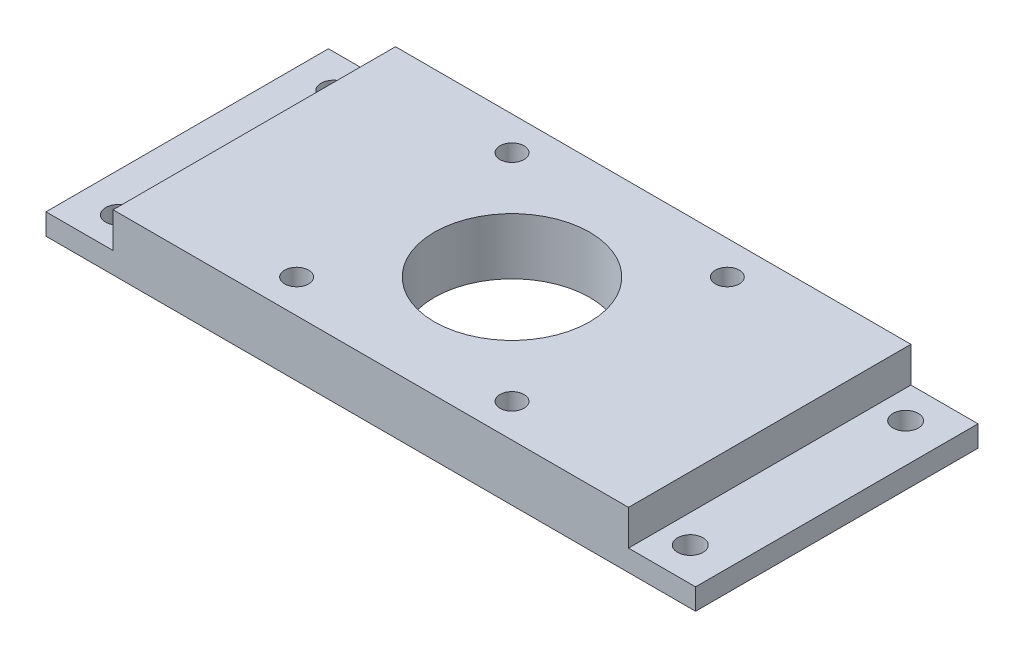
ISO-10303-21;
HEADER;
FILE_DESCRIPTION(('STEP AP214'),'2;1');
FILE_NAME('part.step','',(''),(''),'','','');
FILE_SCHEMA(('AUTOMOTIVE_DESIGN { 1 0 10303 214 1 1 1 1 }'));
ENDSEC;
DATA;
#1=APPLICATION_CONTEXT('core data for automotive mechanical design processes');
#2=APPLICATION_PROTOCOL_DEFINITION('international standard','automotive_design',2000,#1);
#3=PRODUCT_CONTEXT('',#1,'mechanical');
#4=PRODUCT('Part','Part','',(#3));
#5=PRODUCT_RELATED_PRODUCT_CATEGORY('part','',(#4));
#6=PRODUCT_DEFINITION_FORMATION('','',#4);
#7=PRODUCT_DEFINITION_CONTEXT('part definition',#1,'design');
#8=PRODUCT_DEFINITION('design','',#6,#7);
#9=PRODUCT_DEFINITION_SHAPE('','',#8);
#10=(LENGTH_UNIT() NAMED_UNIT(*) SI_UNIT(.MILLI.,.METRE.));
#11=(NAMED_UNIT(*) PLANE_ANGLE_UNIT() SI_UNIT($,.RADIAN.));
#12=(NAMED_UNIT(*) SI_UNIT($,.STERADIAN.) SOLID_ANGLE_UNIT());
#13=UNCERTAINTY_MEASURE_WITH_UNIT(LENGTH_MEASURE(1.E-05),#10,'distance_accuracy_value','');
#14=(GEOMETRIC_REPRESENTATION_CONTEXT(3) GLOBAL_UNCERTAINTY_ASSIGNED_CONTEXT((#13)) GLOBAL_UNIT_ASSIGNED_CONTEXT((#10,
#11,#12)) REPRESENTATION_CONTEXT('',''));
#15=CARTESIAN_POINT('',(0.,0.,0.));
#16=DIRECTION('',(0.,0.,1.));
#17=DIRECTION('',(1.,0.,0.));
#18=AXIS2_PLACEMENT_3D('',#15,#16,#17);
#19=CARTESIAN_POINT('',(36.5,5.,20.));
#20=DIRECTION('',(-1.,0.,0.));
#21=DIRECTION('',(0.,0.,1.));
#22=AXIS2_PLACEMENT_3D('',#19,#20,#21);
#23=PLANE('',#22);
#24=DIRECTION('',(0.,0.,-1.));
#25=VECTOR('',#24,1.);
#26=CARTESIAN_POINT('',(36.5,0.,20.));
#27=LINE('',#26,#25);
#28=CARTESIAN_POINT('',(36.5,0.,20.));
#29=VERTEX_POINT('',#28);
#30=CARTESIAN_POINT('',(36.5,0.,-20.));
#31=VERTEX_POINT('',#30);
#32=EDGE_CURVE('E130',#29,#31,#27,.T.);
#33=ORIENTED_EDGE('',*,*,#32,.T.);
#34=DIRECTION('',(0.,-1.,0.));
#35=VECTOR('',#34,1.);
#36=CARTESIAN_POINT('',(36.5,5.,-20.));
#37=LINE('',#36,#35);
#38=CARTESIAN_POINT('',(36.5,5.,-20.));
#39=VERTEX_POINT('',#38);
#40=EDGE_CURVE('E11',#39,#31,#37,.T.);
#41=ORIENTED_EDGE('',*,*,#40,.F.);
#42=DIRECTION('',(0.,0.,-1.));
#43=VECTOR('',#42,1.);
#44=CARTESIAN_POINT('',(36.5,5.,20.));
#45=LINE('',#44,#43);
#46=CARTESIAN_POINT('',(36.5,5.,20.));
#47=VERTEX_POINT('',#46);
#48=EDGE_CURVE('E141',#47,#39,#45,.T.);
#49=ORIENTED_EDGE('',*,*,#48,.F.);
#50=DIRECTION('',(0.,-1.,0.));
#51=VECTOR('',#50,1.);
#52=CARTESIAN_POINT('',(36.5,5.,20.));
#53=LINE('',#52,#51);
#54=EDGE_CURVE('E151',#47,#29,#53,.T.);
#55=ORIENTED_EDGE('',*,*,#54,.T.);
#56=EDGE_LOOP('',(#33,#41,#49,#55));
#57=FACE_BOUND('',#56,.T.);
#58=ADVANCED_FACE('F39',(#57),#23,.F.);
#59=CARTESIAN_POINT('',(-36.5,5.,-20.));
#60=DIRECTION('',(0.,0.,1.));
#61=DIRECTION('',(1.,0.,0.));
#62=AXIS2_PLACEMENT_3D('',#59,#60,#61);
#63=PLANE('',#62);
#64=ORIENTED_EDGE('',*,*,#40,.T.);
#65=DIRECTION('',(1.,0.,0.));
#66=VECTOR('',#65,1.);
#67=CARTESIAN_POINT('',(-46.,0.,-20.));
#68=LINE('',#67,#66);
#69=CARTESIAN_POINT('',(46.,0.,-20.));
#70=VERTEX_POINT('',#69);
#71=EDGE_CURVE('E177',#31,#70,#68,.T.);
#72=ORIENTED_EDGE('',*,*,#71,.T.);
#73=DIRECTION('',(0.,1.,0.));
#74=VECTOR('',#73,1.);
#75=CARTESIAN_POINT('',(46.,-3.,-20.));
#76=LINE('',#75,#74);
#77=CARTESIAN_POINT('',(46.,-3.,-20.));
#78=VERTEX_POINT('',#77);
#79=EDGE_CURVE('E184',#78,#70,#76,.T.);
#80=ORIENTED_EDGE('',*,*,#79,.F.);
#81=DIRECTION('',(1.,0.,0.));
#82=VECTOR('',#81,1.);
#83=CARTESIAN_POINT('',(-46.,-3.,-20.));
#84=LINE('',#83,#82);
#85=CARTESIAN_POINT('',(-46.,-3.,-20.));
#86=VERTEX_POINT('',#85);
#87=EDGE_CURVE('E119',#86,#78,#84,.T.);
#88=ORIENTED_EDGE('',*,*,#87,.F.);
#89=DIRECTION('',(0.,1.,0.));
#90=VECTOR('',#89,1.);
#91=CARTESIAN_POINT('',(-46.,-3.,-20.));
#92=LINE('',#91,#90);
#93=CARTESIAN_POINT('',(-46.,0.,-20.));
#94=VERTEX_POINT('',#93);
#95=EDGE_CURVE('E137',#86,#94,#92,.T.);
#96=ORIENTED_EDGE('',*,*,#95,.T.);
#97=CARTESIAN_POINT('',(-36.5,0.,-20.));
#98=VERTEX_POINT('',#97);
#99=EDGE_CURVE('E124',#94,#98,#68,.T.);
#100=ORIENTED_EDGE('',*,*,#99,.T.);
#101=DIRECTION('',(0.,-1.,0.));
#102=VECTOR('',#101,1.);
#103=CARTESIAN_POINT('',(-36.5,5.,-20.));
#104=LINE('',#103,#102);
#105=CARTESIAN_POINT('',(-36.5,5.,-20.));
#106=VERTEX_POINT('',#105);
#107=EDGE_CURVE('E48',#106,#98,#104,.T.);
#108=ORIENTED_EDGE('',*,*,#107,.F.);
#109=DIRECTION('',(-1.,0.,0.));
#110=VECTOR('',#109,1.);
#111=CARTESIAN_POINT('',(-36.5,5.,-20.));
#112=LINE('',#111,#110);
#113=EDGE_CURVE('E144',#39,#106,#112,.T.);
#114=ORIENTED_EDGE('',*,*,#113,.F.);
#115=EDGE_LOOP('',(#64,#72,#80,#88,#96,#100,#108,#114));
#116=FACE_BOUND('',#115,.T.);
#117=ADVANCED_FACE('F170',(#116),#63,.F.);
#118=CARTESIAN_POINT('',(-36.5,5.,20.));
#119=DIRECTION('',(1.,0.,0.));
#120=DIRECTION('',(0.,0.,-1.));
#121=AXIS2_PLACEMENT_3D('',#118,#119,#120);
#122=PLANE('',#121);
#123=DIRECTION('',(0.,0.,1.));
#124=VECTOR('',#123,1.);
#125=CARTESIAN_POINT('',(-36.5,0.,20.));
#126=LINE('',#125,#124);
#127=CARTESIAN_POINT('',(-36.5,0.,20.));
#128=VERTEX_POINT('',#127);
#129=EDGE_CURVE('E135',#98,#128,#126,.T.);
#130=ORIENTED_EDGE('',*,*,#129,.T.);
#131=DIRECTION('',(0.,-1.,0.));
#132=VECTOR('',#131,1.);
#133=CARTESIAN_POINT('',(-36.5,5.,20.));
#134=LINE('',#133,#132);
#135=CARTESIAN_POINT('',(-36.5,5.,20.));
#136=VERTEX_POINT('',#135);
#137=EDGE_CURVE('E159',#136,#128,#134,.T.);
#138=ORIENTED_EDGE('',*,*,#137,.F.);
#139=DIRECTION('',(0.,0.,1.));
#140=VECTOR('',#139,1.);
#141=CARTESIAN_POINT('',(-36.5,5.,20.));
#142=LINE('',#141,#140);
#143=EDGE_CURVE('E147',#106,#136,#142,.T.);
#144=ORIENTED_EDGE('',*,*,#143,.F.);
#145=ORIENTED_EDGE('',*,*,#107,.T.);
#146=EDGE_LOOP('',(#130,#138,#144,#145));
#147=FACE_BOUND('',#146,.T.);
#148=ADVANCED_FACE('F166',(#147),#122,.F.);
#149=CARTESIAN_POINT('',(-36.5,5.,20.));
#150=DIRECTION('',(0.,0.,-1.));
#151=DIRECTION('',(-1.,0.,0.));
#152=AXIS2_PLACEMENT_3D('',#149,#150,#151);
#153=PLANE('',#152);
#154=ORIENTED_EDGE('',*,*,#137,.T.);
#155=DIRECTION('',(-1.,0.,0.));
#156=VECTOR('',#155,1.);
#157=CARTESIAN_POINT('',(-46.,0.,20.));
#158=LINE('',#157,#156);
#159=CARTESIAN_POINT('',(-46.,0.,20.));
#160=VERTEX_POINT('',#159);
#161=EDGE_CURVE('E193',#128,#160,#158,.T.);
#162=ORIENTED_EDGE('',*,*,#161,.T.);
#163=DIRECTION('',(0.,1.,0.));
#164=VECTOR('',#163,1.);
#165=CARTESIAN_POINT('',(-46.,-3.,20.));
#166=LINE('',#165,#164);
#167=CARTESIAN_POINT('',(-46.,-3.,20.));
#168=VERTEX_POINT('',#167);
#169=EDGE_CURVE('E109',#168,#160,#166,.T.);
#170=ORIENTED_EDGE('',*,*,#169,.F.);
#171=DIRECTION('',(-1.,0.,0.));
#172=VECTOR('',#171,1.);
#173=CARTESIAN_POINT('',(-46.,-3.,20.));
#174=LINE('',#173,#172);
#175=CARTESIAN_POINT('',(46.,-3.,20.));
#176=VERTEX_POINT('',#175);
#177=EDGE_CURVE('E100',#176,#168,#174,.T.);
#178=ORIENTED_EDGE('',*,*,#177,.F.);
#179=DIRECTION('',(0.,1.,0.));
#180=VECTOR('',#179,1.);
#181=CARTESIAN_POINT('',(46.,-3.,20.));
#182=LINE('',#181,#180);
#183=CARTESIAN_POINT('',(46.,0.,20.));
#184=VERTEX_POINT('',#183);
#185=EDGE_CURVE('E106',#176,#184,#182,.T.);
#186=ORIENTED_EDGE('',*,*,#185,.T.);
#187=EDGE_CURVE('E195',#184,#29,#158,.T.);
#188=ORIENTED_EDGE('',*,*,#187,.T.);
#189=ORIENTED_EDGE('',*,*,#54,.F.);
#190=DIRECTION('',(1.,0.,0.));
#191=VECTOR('',#190,1.);
#192=CARTESIAN_POINT('',(-36.5,5.,20.));
#193=LINE('',#192,#191);
#194=EDGE_CURVE('E55',#136,#47,#193,.T.);
#195=ORIENTED_EDGE('',*,*,#194,.F.);
#196=EDGE_LOOP('',(#154,#162,#170,#178,#186,#188,#189,#195));
#197=FACE_BOUND('',#196,.T.);
#198=ADVANCED_FACE('F103',(#197),#153,.F.);
#199=CARTESIAN_POINT('',(0.,5.,0.));
#200=DIRECTION('',(0.,-1.,0.));
#201=DIRECTION('',(0.,0.,-1.));
#202=AXIS2_PLACEMENT_3D('',#199,#200,#201);
#203=PLANE('',#202);
#204=CARTESIAN_POINT('',(0.,5.,0.));
#205=DIRECTION('',(0.,1.,0.));
#206=DIRECTION('',(0.,0.,1.));
#207=AXIS2_PLACEMENT_3D('',#204,#205,#206);
#208=CIRCLE('',#207,11.);
#209=CARTESIAN_POINT('',(0.,5.,11.));
#210=VERTEX_POINT('',#209);
#211=EDGE_CURVE('E381',#210,#210,#208,.T.);
#212=ORIENTED_EDGE('',*,*,#211,.F.);
#213=EDGE_LOOP('',(#212));
#214=FACE_BOUND('',#213,.T.);
#215=CARTESIAN_POINT('',(15.25,5.,-15.25));
#216=DIRECTION('',(0.,1.,0.));
#217=DIRECTION('',(0.,0.,1.));
#218=AXIS2_PLACEMENT_3D('',#215,#216,#217);
#219=CIRCLE('',#218,1.7);
#220=CARTESIAN_POINT('',(15.25,5.,-13.55));
#221=VERTEX_POINT('',#220);
#222=EDGE_CURVE('E385',#221,#221,#219,.T.);
#223=ORIENTED_EDGE('',*,*,#222,.F.);
#224=EDGE_LOOP('',(#223));
#225=FACE_BOUND('',#224,.T.);
#226=CARTESIAN_POINT('',(-15.25,5.,15.25));
#227=DIRECTION('',(0.,1.,0.));
#228=DIRECTION('',(0.,0.,1.));
#229=AXIS2_PLACEMENT_3D('',#226,#227,#228);
#230=CIRCLE('',#229,1.7);
#231=CARTESIAN_POINT('',(-15.25,5.,16.95));
#232=VERTEX_POINT('',#231);
#233=EDGE_CURVE('E395',#232,#232,#230,.T.);
#234=ORIENTED_EDGE('',*,*,#233,.F.);
#235=EDGE_LOOP('',(#234));
#236=FACE_BOUND('',#235,.T.);
#237=CARTESIAN_POINT('',(-15.25,5.,-15.25));
#238=DIRECTION('',(0.,1.,0.));
#239=DIRECTION('',(0.,0.,1.));
#240=AXIS2_PLACEMENT_3D('',#237,#238,#239);
#241=CIRCLE('',#240,1.7);
#242=CARTESIAN_POINT('',(-15.25,5.,-13.55));
#243=VERTEX_POINT('',#242);
#244=EDGE_CURVE('E403',#243,#243,#241,.T.);
#245=ORIENTED_EDGE('',*,*,#244,.F.);
#246=EDGE_LOOP('',(#245));
#247=FACE_BOUND('',#246,.T.);
#248=CARTESIAN_POINT('',(15.25,5.,15.25));
#249=DIRECTION('',(0.,1.,0.));
#250=DIRECTION('',(0.,0.,1.));
#251=AXIS2_PLACEMENT_3D('',#248,#249,#250);
#252=CIRCLE('',#251,1.7);
#253=CARTESIAN_POINT('',(15.25,5.,16.95));
#254=VERTEX_POINT('',#253);
#255=EDGE_CURVE('E411',#254,#254,#252,.T.);
#256=ORIENTED_EDGE('',*,*,#255,.F.);
#257=EDGE_LOOP('',(#256));
#258=FACE_BOUND('',#257,.T.);
#259=ORIENTED_EDGE('',*,*,#48,.T.);
#260=ORIENTED_EDGE('',*,*,#113,.T.);
#261=ORIENTED_EDGE('',*,*,#143,.T.);
#262=ORIENTED_EDGE('',*,*,#194,.T.);
#263=EDGE_LOOP('',(#259,#260,#261,#262));
#264=FACE_BOUND('',#263,.T.);
#265=ADVANCED_FACE('F212',(#214,#225,#236,#247,#258,#264),#203,.F.);
#266=CARTESIAN_POINT('',(0.,0.,0.));
#267=DIRECTION('',(0.,1.,0.));
#268=DIRECTION('',(0.,0.,1.));
#269=AXIS2_PLACEMENT_3D('',#266,#267,#268);
#270=PLANE('',#269);
#271=CARTESIAN_POINT('',(40.5,0.,-15.25));
#272=DIRECTION('',(0.,1.,0.));
#273=DIRECTION('',(0.,0.,1.));
#274=AXIS2_PLACEMENT_3D('',#271,#272,#273);
#275=CIRCLE('',#274,1.8);
#276=CARTESIAN_POINT('',(40.5,0.,-13.45));
#277=VERTEX_POINT('',#276);
#278=EDGE_CURVE('E435',#277,#277,#275,.T.);
#279=ORIENTED_EDGE('',*,*,#278,.F.);
#280=EDGE_LOOP('',(#279));
#281=FACE_BOUND('',#280,.T.);
#282=CARTESIAN_POINT('',(40.5,0.,15.25));
#283=DIRECTION('',(0.,1.,0.));
#284=DIRECTION('',(0.,0.,1.));
#285=AXIS2_PLACEMENT_3D('',#282,#283,#284);
#286=CIRCLE('',#285,1.8);
#287=CARTESIAN_POINT('',(40.5,0.,17.05));
#288=VERTEX_POINT('',#287);
#289=EDGE_CURVE('E443',#288,#288,#286,.T.);
#290=ORIENTED_EDGE('',*,*,#289,.F.);
#291=EDGE_LOOP('',(#290));
#292=FACE_BOUND('',#291,.T.);
#293=ORIENTED_EDGE('',*,*,#32,.F.);
#294=ORIENTED_EDGE('',*,*,#187,.F.);
#295=DIRECTION('',(0.,0.,1.));
#296=VECTOR('',#295,1.);
#297=CARTESIAN_POINT('',(46.,0.,-20.));
#298=LINE('',#297,#296);
#299=EDGE_CURVE('E128',#70,#184,#298,.T.);
#300=ORIENTED_EDGE('',*,*,#299,.F.);
#301=ORIENTED_EDGE('',*,*,#71,.F.);
#302=EDGE_LOOP('',(#293,#294,#300,#301));
#303=FACE_BOUND('',#302,.T.);
#304=ADVANCED_FACE('F204',(#281,#292,#303),#270,.T.);
#305=CARTESIAN_POINT('',(-40.5,0.,-15.25));
#306=DIRECTION('',(0.,1.,0.));
#307=DIRECTION('',(0.,0.,1.));
#308=AXIS2_PLACEMENT_3D('',#305,#306,#307);
#309=CIRCLE('',#308,1.8);
#310=CARTESIAN_POINT('',(-40.5,0.,-13.45));
#311=VERTEX_POINT('',#310);
#312=EDGE_CURVE('E419',#311,#311,#309,.T.);
#313=ORIENTED_EDGE('',*,*,#312,.F.);
#314=EDGE_LOOP('',(#313));
#315=FACE_BOUND('',#314,.T.);
#316=CARTESIAN_POINT('',(-40.5,0.,15.25));
#317=DIRECTION('',(0.,1.,0.));
#318=DIRECTION('',(0.,0.,1.));
#319=AXIS2_PLACEMENT_3D('',#316,#317,#318);
#320=CIRCLE('',#319,1.8);
#321=CARTESIAN_POINT('',(-40.5,0.,17.05));
#322=VERTEX_POINT('',#321);
#323=EDGE_CURVE('E427',#322,#322,#320,.T.);
#324=ORIENTED_EDGE('',*,*,#323,.F.);
#325=EDGE_LOOP('',(#324));
#326=FACE_BOUND('',#325,.T.);
#327=ORIENTED_EDGE('',*,*,#129,.F.);
#328=ORIENTED_EDGE('',*,*,#99,.F.);
#329=DIRECTION('',(0.,0.,-1.));
#330=VECTOR('',#329,1.);
#331=CARTESIAN_POINT('',(-46.,0.,-20.));
#332=LINE('',#331,#330);
#333=EDGE_CURVE('E180',#160,#94,#332,.T.);
#334=ORIENTED_EDGE('',*,*,#333,.F.);
#335=ORIENTED_EDGE('',*,*,#161,.F.);
#336=EDGE_LOOP('',(#327,#328,#334,#335));
#337=FACE_BOUND('',#336,.T.);
#338=ADVANCED_FACE('F202',(#315,#326,#337),#270,.T.);
#339=CARTESIAN_POINT('',(46.,-3.,-20.));
#340=DIRECTION('',(-1.,0.,0.));
#341=DIRECTION('',(0.,0.,1.));
#342=AXIS2_PLACEMENT_3D('',#339,#340,#341);
#343=PLANE('',#342);
#344=ORIENTED_EDGE('',*,*,#299,.T.);
#345=ORIENTED_EDGE('',*,*,#185,.F.);
#346=DIRECTION('',(0.,0.,1.));
#347=VECTOR('',#346,1.);
#348=CARTESIAN_POINT('',(46.,-3.,-20.));
#349=LINE('',#348,#347);
#350=EDGE_CURVE('E114',#78,#176,#349,.T.);
#351=ORIENTED_EDGE('',*,*,#350,.F.);
#352=ORIENTED_EDGE('',*,*,#79,.T.);
#353=EDGE_LOOP('',(#344,#345,#351,#352));
#354=FACE_BOUND('',#353,.T.);
#355=ADVANCED_FACE('F126',(#354),#343,.F.);
#356=CARTESIAN_POINT('',(-46.,-3.,-20.));
#357=DIRECTION('',(1.,0.,0.));
#358=DIRECTION('',(0.,0.,-1.));
#359=AXIS2_PLACEMENT_3D('',#356,#357,#358);
#360=PLANE('',#359);
#361=ORIENTED_EDGE('',*,*,#333,.T.);
#362=ORIENTED_EDGE('',*,*,#95,.F.);
#363=DIRECTION('',(0.,0.,-1.));
#364=VECTOR('',#363,1.);
#365=CARTESIAN_POINT('',(-46.,-3.,-20.));
#366=LINE('',#365,#364);
#367=EDGE_CURVE('E113',#168,#86,#366,.T.);
#368=ORIENTED_EDGE('',*,*,#367,.F.);
#369=ORIENTED_EDGE('',*,*,#169,.T.);
#370=EDGE_LOOP('',(#361,#362,#368,#369));
#371=FACE_BOUND('',#370,.T.);
#372=ADVANCED_FACE('F201',(#371),#360,.F.);
#373=CARTESIAN_POINT('',(0.,-3.,0.));
#374=DIRECTION('',(0.,1.,0.));
#375=DIRECTION('',(0.,0.,1.));
#376=AXIS2_PLACEMENT_3D('',#373,#374,#375);
#377=PLANE('',#376);
#378=CARTESIAN_POINT('',(0.,-3.,0.));
#379=DIRECTION('',(0.,1.,0.));
#380=DIRECTION('',(0.,0.,1.));
#381=AXIS2_PLACEMENT_3D('',#378,#379,#380);
#382=CIRCLE('',#381,11.);
#383=CARTESIAN_POINT('',(0.,-3.,11.));
#384=VERTEX_POINT('',#383);
#385=EDGE_CURVE('E379',#384,#384,#382,.T.);
#386=ORIENTED_EDGE('',*,*,#385,.T.);
#387=EDGE_LOOP('',(#386));
#388=FACE_BOUND('',#387,.T.);
#389=CARTESIAN_POINT('',(15.25,-3.,-15.25));
#390=DIRECTION('',(0.,1.,0.));
#391=DIRECTION('',(0.,0.,1.));
#392=AXIS2_PLACEMENT_3D('',#389,#390,#391);
#393=CIRCLE('',#392,1.7);
#394=CARTESIAN_POINT('',(15.25,-3.,-13.55));
#395=VERTEX_POINT('',#394);
#396=EDGE_CURVE('E391',#395,#395,#393,.T.);
#397=ORIENTED_EDGE('',*,*,#396,.T.);
#398=EDGE_LOOP('',(#397));
#399=FACE_BOUND('',#398,.T.);
#400=CARTESIAN_POINT('',(-15.25,-3.,15.25));
#401=DIRECTION('',(0.,1.,0.));
#402=DIRECTION('',(0.,0.,1.));
#403=AXIS2_PLACEMENT_3D('',#400,#401,#402);
#404=CIRCLE('',#403,1.7);
#405=CARTESIAN_POINT('',(-15.25,-3.,16.95));
#406=VERTEX_POINT('',#405);
#407=EDGE_CURVE('E399',#406,#406,#404,.T.);
#408=ORIENTED_EDGE('',*,*,#407,.T.);
#409=EDGE_LOOP('',(#408));
#410=FACE_BOUND('',#409,.T.);
#411=CARTESIAN_POINT('',(-15.25,-3.,-15.25));
#412=DIRECTION('',(0.,1.,0.));
#413=DIRECTION('',(0.,0.,1.));
#414=AXIS2_PLACEMENT_3D('',#411,#412,#413);
#415=CIRCLE('',#414,1.7);
#416=CARTESIAN_POINT('',(-15.25,-3.,-13.55));
#417=VERTEX_POINT('',#416);
#418=EDGE_CURVE('E407',#417,#417,#415,.T.);
#419=ORIENTED_EDGE('',*,*,#418,.T.);
#420=EDGE_LOOP('',(#419));
#421=FACE_BOUND('',#420,.T.);
#422=CARTESIAN_POINT('',(15.25,-3.,15.25));
#423=DIRECTION('',(0.,1.,0.));
#424=DIRECTION('',(0.,0.,1.));
#425=AXIS2_PLACEMENT_3D('',#422,#423,#424);
#426=CIRCLE('',#425,1.7);
#427=CARTESIAN_POINT('',(15.25,-3.,16.95));
#428=VERTEX_POINT('',#427);
#429=EDGE_CURVE('E415',#428,#428,#426,.T.);
#430=ORIENTED_EDGE('',*,*,#429,.T.);
#431=EDGE_LOOP('',(#430));
#432=FACE_BOUND('',#431,.T.);
#433=CARTESIAN_POINT('',(-40.5,-3.,-15.25));
#434=DIRECTION('',(0.,1.,0.));
#435=DIRECTION('',(0.,0.,1.));
#436=AXIS2_PLACEMENT_3D('',#433,#434,#435);
#437=CIRCLE('',#436,1.8);
#438=CARTESIAN_POINT('',(-40.5,-3.,-13.45));
#439=VERTEX_POINT('',#438);
#440=EDGE_CURVE('E423',#439,#439,#437,.T.);
#441=ORIENTED_EDGE('',*,*,#440,.T.);
#442=EDGE_LOOP('',(#441));
#443=FACE_BOUND('',#442,.T.);
#444=CARTESIAN_POINT('',(-40.5,-3.,15.25));
#445=DIRECTION('',(0.,1.,0.));
#446=DIRECTION('',(0.,0.,1.));
#447=AXIS2_PLACEMENT_3D('',#444,#445,#446);
#448=CIRCLE('',#447,1.8);
#449=CARTESIAN_POINT('',(-40.5,-3.,17.05));
#450=VERTEX_POINT('',#449);
#451=EDGE_CURVE('E431',#450,#450,#448,.T.);
#452=ORIENTED_EDGE('',*,*,#451,.T.);
#453=EDGE_LOOP('',(#452));
#454=FACE_BOUND('',#453,.T.);
#455=CARTESIAN_POINT('',(40.5,-3.,-15.25));
#456=DIRECTION('',(0.,1.,0.));
#457=DIRECTION('',(0.,0.,1.));
#458=AXIS2_PLACEMENT_3D('',#455,#456,#457);
#459=CIRCLE('',#458,1.8);
#460=CARTESIAN_POINT('',(40.5,-3.,-13.45));
#461=VERTEX_POINT('',#460);
#462=EDGE_CURVE('E439',#461,#461,#459,.T.);
#463=ORIENTED_EDGE('',*,*,#462,.T.);
#464=EDGE_LOOP('',(#463));
#465=FACE_BOUND('',#464,.T.);
#466=CARTESIAN_POINT('',(40.5,-3.,15.25));
#467=DIRECTION('',(0.,1.,0.));
#468=DIRECTION('',(0.,0.,1.));
#469=AXIS2_PLACEMENT_3D('',#466,#467,#468);
#470=CIRCLE('',#469,1.8);
#471=CARTESIAN_POINT('',(40.5,-3.,17.05));
#472=VERTEX_POINT('',#471);
#473=EDGE_CURVE('E194',#472,#472,#470,.T.);
#474=ORIENTED_EDGE('',*,*,#473,.T.);
#475=EDGE_LOOP('',(#474));
#476=FACE_BOUND('',#475,.T.);
#477=ORIENTED_EDGE('',*,*,#350,.T.);
#478=ORIENTED_EDGE('',*,*,#177,.T.);
#479=ORIENTED_EDGE('',*,*,#367,.T.);
#480=ORIENTED_EDGE('',*,*,#87,.T.);
#481=EDGE_LOOP('',(#477,#478,#479,#480));
#482=FACE_BOUND('',#481,.T.);
#483=ADVANCED_FACE('F117',(#388,#399,#410,#421,#432,#443,#454,#465,#476,#482),#377,.F.);
#484=CARTESIAN_POINT('',(40.5,0.,15.25));
#485=DIRECTION('',(0.,1.,0.));
#486=DIRECTION('',(0.,0.,1.));
#487=AXIS2_PLACEMENT_3D('',#484,#485,#486);
#488=CYLINDRICAL_SURFACE('',#487,1.8);
#489=ORIENTED_EDGE('',*,*,#473,.F.);
#490=EDGE_LOOP('',(#489));
#491=FACE_BOUND('',#490,.T.);
#492=ORIENTED_EDGE('',*,*,#289,.T.);
#493=EDGE_LOOP('',(#492));
#494=FACE_BOUND('',#493,.T.);
#495=ADVANCED_FACE('F277',(#491,#494),#488,.F.);
#496=CARTESIAN_POINT('',(40.5,0.,-15.25));
#497=DIRECTION('',(0.,1.,0.));
#498=DIRECTION('',(0.,0.,1.));
#499=AXIS2_PLACEMENT_3D('',#496,#497,#498);
#500=CYLINDRICAL_SURFACE('',#499,1.8);
#501=ORIENTED_EDGE('',*,*,#462,.F.);
#502=EDGE_LOOP('',(#501));
#503=FACE_BOUND('',#502,.T.);
#504=ORIENTED_EDGE('',*,*,#278,.T.);
#505=EDGE_LOOP('',(#504));
#506=FACE_BOUND('',#505,.T.);
#507=ADVANCED_FACE('F282',(#503,#506),#500,.F.);
#508=CARTESIAN_POINT('',(-40.5,0.,15.25));
#509=DIRECTION('',(0.,1.,0.));
#510=DIRECTION('',(0.,0.,1.));
#511=AXIS2_PLACEMENT_3D('',#508,#509,#510);
#512=CYLINDRICAL_SURFACE('',#511,1.8);
#513=ORIENTED_EDGE('',*,*,#451,.F.);
#514=EDGE_LOOP('',(#513));
#515=FACE_BOUND('',#514,.T.);
#516=ORIENTED_EDGE('',*,*,#323,.T.);
#517=EDGE_LOOP('',(#516));
#518=FACE_BOUND('',#517,.T.);
#519=ADVANCED_FACE('F292',(#515,#518),#512,.F.);
#520=CARTESIAN_POINT('',(-40.5,0.,-15.25));
#521=DIRECTION('',(0.,1.,0.));
#522=DIRECTION('',(0.,0.,1.));
#523=AXIS2_PLACEMENT_3D('',#520,#521,#522);
#524=CYLINDRICAL_SURFACE('',#523,1.8);
#525=ORIENTED_EDGE('',*,*,#440,.F.);
#526=EDGE_LOOP('',(#525));
#527=FACE_BOUND('',#526,.T.);
#528=ORIENTED_EDGE('',*,*,#312,.T.);
#529=EDGE_LOOP('',(#528));
#530=FACE_BOUND('',#529,.T.);
#531=ADVANCED_FACE('F302',(#527,#530),#524,.F.);
#532=CARTESIAN_POINT('',(15.25,5.,15.25));
#533=DIRECTION('',(0.,1.,0.));
#534=DIRECTION('',(0.,0.,1.));
#535=AXIS2_PLACEMENT_3D('',#532,#533,#534);
#536=CYLINDRICAL_SURFACE('',#535,1.7);
#537=ORIENTED_EDGE('',*,*,#429,.F.);
#538=EDGE_LOOP('',(#537));
#539=FACE_BOUND('',#538,.T.);
#540=ORIENTED_EDGE('',*,*,#255,.T.);
#541=EDGE_LOOP('',(#540));
#542=FACE_BOUND('',#541,.T.);
#543=ADVANCED_FACE('F312',(#539,#542),#536,.F.);
#544=CARTESIAN_POINT('',(-15.25,5.,-15.25));
#545=DIRECTION('',(0.,1.,0.));
#546=DIRECTION('',(0.,0.,1.));
#547=AXIS2_PLACEMENT_3D('',#544,#545,#546);
#548=CYLINDRICAL_SURFACE('',#547,1.7);
#549=ORIENTED_EDGE('',*,*,#418,.F.);
#550=EDGE_LOOP('',(#549));
#551=FACE_BOUND('',#550,.T.);
#552=ORIENTED_EDGE('',*,*,#244,.T.);
#553=EDGE_LOOP('',(#552));
#554=FACE_BOUND('',#553,.T.);
#555=ADVANCED_FACE('F322',(#551,#554),#548,.F.);
#556=CARTESIAN_POINT('',(-15.25,5.,15.25));
#557=DIRECTION('',(0.,1.,0.));
#558=DIRECTION('',(0.,0.,1.));
#559=AXIS2_PLACEMENT_3D('',#556,#557,#558);
#560=CYLINDRICAL_SURFACE('',#559,1.7);
#561=ORIENTED_EDGE('',*,*,#407,.F.);
#562=EDGE_LOOP('',(#561));
#563=FACE_BOUND('',#562,.T.);
#564=ORIENTED_EDGE('',*,*,#233,.T.);
#565=EDGE_LOOP('',(#564));
#566=FACE_BOUND('',#565,.T.);
#567=ADVANCED_FACE('F332',(#563,#566),#560,.F.);
#568=CARTESIAN_POINT('',(15.25,5.,-15.25));
#569=DIRECTION('',(0.,1.,0.));
#570=DIRECTION('',(0.,0.,1.));
#571=AXIS2_PLACEMENT_3D('',#568,#569,#570);
#572=CYLINDRICAL_SURFACE('',#571,1.7);
#573=ORIENTED_EDGE('',*,*,#396,.F.);
#574=EDGE_LOOP('',(#573));
#575=FACE_BOUND('',#574,.T.);
#576=ORIENTED_EDGE('',*,*,#222,.T.);
#577=EDGE_LOOP('',(#576));
#578=FACE_BOUND('',#577,.T.);
#579=ADVANCED_FACE('F342',(#575,#578),#572,.F.);
#580=CARTESIAN_POINT('',(0.,-3.,0.));
#581=DIRECTION('',(0.,1.,0.));
#582=DIRECTION('',(0.,0.,1.));
#583=AXIS2_PLACEMENT_3D('',#580,#581,#582);
#584=CYLINDRICAL_SURFACE('',#583,11.);
#585=ORIENTED_EDGE('',*,*,#385,.F.);
#586=EDGE_LOOP('',(#585));
#587=FACE_BOUND('',#586,.T.);
#588=ORIENTED_EDGE('',*,*,#211,.T.);
#589=EDGE_LOOP('',(#588));
#590=FACE_BOUND('',#589,.T.);
#591=ADVANCED_FACE('F351',(#587,#590),#584,.F.);
#592=CLOSED_SHELL('',(#58,#117,#148,#198,#265,#304,#338,#355,#372,#483,#495,#507,#519,#531,#543,
#555,#567,#579,#591));
#593=MANIFOLD_SOLID_BREP('B2',#592);
#594=ADVANCED_BREP_SHAPE_REPRESENTATION('',(#18,#593),#14);
#595=SHAPE_DEFINITION_REPRESENTATION(#9,#594);
ENDSEC;
END-ISO-10303-21;
